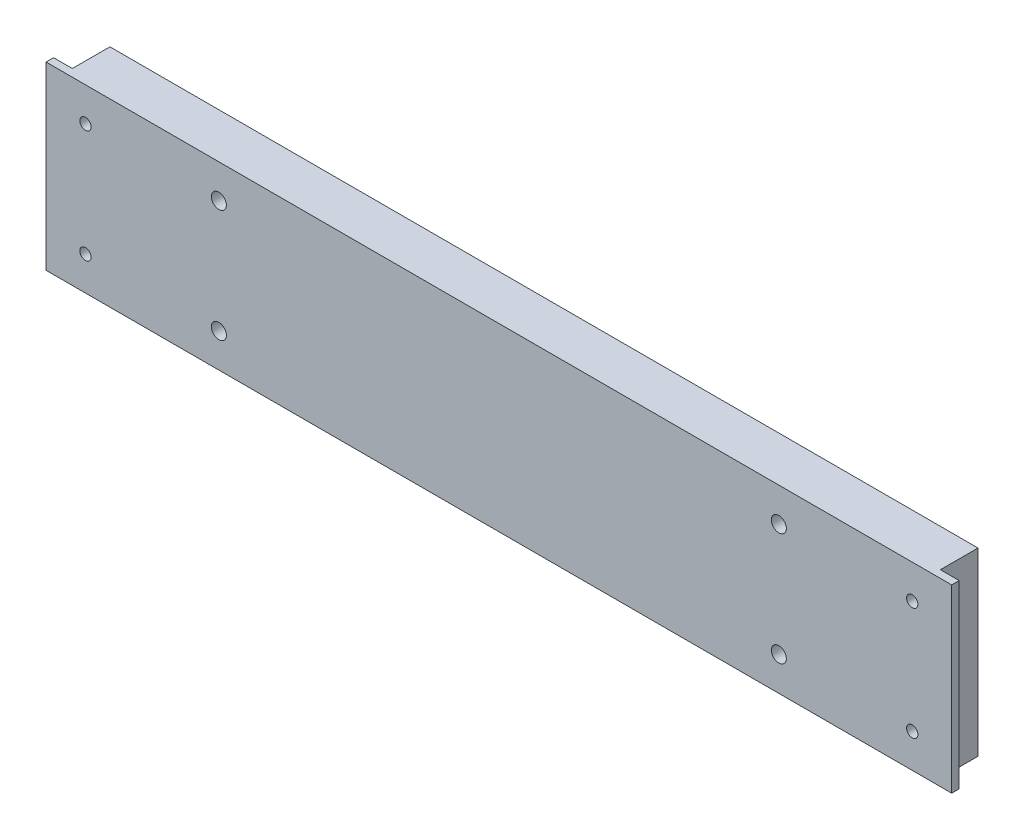
ISO-10303-21;
HEADER;
FILE_DESCRIPTION(('STEP AP214'),'2;1');
FILE_NAME('part.step','',(''),(''),'','','');
FILE_SCHEMA(('AUTOMOTIVE_DESIGN { 1 0 10303 214 1 1 1 1 }'));
ENDSEC;
DATA;
#1=APPLICATION_CONTEXT('core data for automotive mechanical design processes');
#2=APPLICATION_PROTOCOL_DEFINITION('international standard','automotive_design',2000,#1);
#3=PRODUCT_CONTEXT('',#1,'mechanical');
#4=PRODUCT('Part','Part','',(#3));
#5=PRODUCT_RELATED_PRODUCT_CATEGORY('part','',(#4));
#6=PRODUCT_DEFINITION_FORMATION('','',#4);
#7=PRODUCT_DEFINITION_CONTEXT('part definition',#1,'design');
#8=PRODUCT_DEFINITION('design','',#6,#7);
#9=PRODUCT_DEFINITION_SHAPE('','',#8);
#10=(LENGTH_UNIT() NAMED_UNIT(*) SI_UNIT(.MILLI.,.METRE.));
#11=(NAMED_UNIT(*) PLANE_ANGLE_UNIT() SI_UNIT($,.RADIAN.));
#12=(NAMED_UNIT(*) SI_UNIT($,.STERADIAN.) SOLID_ANGLE_UNIT());
#13=UNCERTAINTY_MEASURE_WITH_UNIT(LENGTH_MEASURE(1.E-05),#10,'distance_accuracy_value','');
#14=(GEOMETRIC_REPRESENTATION_CONTEXT(3) GLOBAL_UNCERTAINTY_ASSIGNED_CONTEXT((#13)) GLOBAL_UNIT_ASSIGNED_CONTEXT((#10,
#11,#12)) REPRESENTATION_CONTEXT('',''));
#15=CARTESIAN_POINT('',(0.,0.,0.));
#16=DIRECTION('',(0.,0.,1.));
#17=DIRECTION('',(1.,0.,0.));
#18=AXIS2_PLACEMENT_3D('',#15,#16,#17);
#19=CARTESIAN_POINT('',(0.,-48.,12.));
#20=DIRECTION('',(0.,0.,1.));
#21=DIRECTION('',(1.,0.,0.));
#22=AXIS2_PLACEMENT_3D('',#19,#20,#21);
#23=PLANE('',#22);
#24=CARTESIAN_POINT('',(46.,-8.99999999999999,12.));
#25=DIRECTION('',(0.,0.,1.));
#26=DIRECTION('',(1.,0.,0.));
#27=AXIS2_PLACEMENT_3D('',#24,#25,#26);
#28=CIRCLE('',#27,2.);
#29=CARTESIAN_POINT('',(48.,-8.99999999999999,12.));
#30=VERTEX_POINT('',#29);
#31=EDGE_CURVE('E172',#30,#30,#28,.T.);
#32=ORIENTED_EDGE('',*,*,#31,.F.);
#33=EDGE_LOOP('',(#32));
#34=FACE_BOUND('',#33,.T.);
#35=CARTESIAN_POINT('',(195.,-39.,12.));
#36=DIRECTION('',(0.,0.,1.));
#37=DIRECTION('',(-1.,0.,0.));
#38=AXIS2_PLACEMENT_3D('',#35,#36,#37);
#39=CIRCLE('',#38,2.00000000000002);
#40=CARTESIAN_POINT('',(193.,-39.,12.));
#41=VERTEX_POINT('',#40);
#42=EDGE_CURVE('E184',#41,#41,#39,.T.);
#43=ORIENTED_EDGE('',*,*,#42,.F.);
#44=EDGE_LOOP('',(#43));
#45=FACE_BOUND('',#44,.T.);
#46=CARTESIAN_POINT('',(230.5,-39.,12.));
#47=DIRECTION('',(0.,0.,1.));
#48=DIRECTION('',(-1.,0.,0.));
#49=AXIS2_PLACEMENT_3D('',#46,#47,#48);
#50=CIRCLE('',#49,1.5);
#51=CARTESIAN_POINT('',(229.,-39.,12.));
#52=VERTEX_POINT('',#51);
#53=EDGE_CURVE('E196',#52,#52,#50,.T.);
#54=ORIENTED_EDGE('',*,*,#53,.F.);
#55=EDGE_LOOP('',(#54));
#56=FACE_BOUND('',#55,.T.);
#57=CARTESIAN_POINT('',(10.5,-9.,12.));
#58=DIRECTION('',(0.,0.,1.));
#59=DIRECTION('',(1.,0.,0.));
#60=AXIS2_PLACEMENT_3D('',#57,#58,#59);
#61=CIRCLE('',#60,1.5);
#62=CARTESIAN_POINT('',(12.,-9.,12.));
#63=VERTEX_POINT('',#62);
#64=EDGE_CURVE('E121',#63,#63,#61,.T.);
#65=ORIENTED_EDGE('',*,*,#64,.F.);
#66=EDGE_LOOP('',(#65));
#67=FACE_BOUND('',#66,.T.);
#68=DIRECTION('',(0.,-1.,0.));
#69=VECTOR('',#68,1.);
#70=CARTESIAN_POINT('',(0.,0.,12.));
#71=LINE('',#70,#69);
#72=CARTESIAN_POINT('',(0.,0.,12.));
#73=VERTEX_POINT('',#72);
#74=CARTESIAN_POINT('',(0.,-48.,12.));
#75=VERTEX_POINT('',#74);
#76=EDGE_CURVE('E123',#73,#75,#71,.T.);
#77=ORIENTED_EDGE('',*,*,#76,.T.);
#78=DIRECTION('',(1.,0.,0.));
#79=VECTOR('',#78,1.);
#80=CARTESIAN_POINT('',(0.,-48.,12.));
#81=LINE('',#80,#79);
#82=CARTESIAN_POINT('',(241.,-48.,12.));
#83=VERTEX_POINT('',#82);
#84=EDGE_CURVE('E147',#75,#83,#81,.T.);
#85=ORIENTED_EDGE('',*,*,#84,.T.);
#86=DIRECTION('',(0.,1.,0.));
#87=VECTOR('',#86,1.);
#88=CARTESIAN_POINT('',(241.,0.,12.));
#89=LINE('',#88,#87);
#90=CARTESIAN_POINT('',(241.,0.,12.));
#91=VERTEX_POINT('',#90);
#92=EDGE_CURVE('E145',#83,#91,#89,.T.);
#93=ORIENTED_EDGE('',*,*,#92,.T.);
#94=DIRECTION('',(-1.,0.,0.));
#95=VECTOR('',#94,1.);
#96=CARTESIAN_POINT('',(0.,0.,12.));
#97=LINE('',#96,#95);
#98=EDGE_CURVE('E129',#91,#73,#97,.T.);
#99=ORIENTED_EDGE('',*,*,#98,.T.);
#100=EDGE_LOOP('',(#77,#85,#93,#99));
#101=FACE_BOUND('',#100,.T.);
#102=CARTESIAN_POINT('',(10.5,-39.,12.));
#103=DIRECTION('',(0.,0.,1.));
#104=DIRECTION('',(1.,0.,0.));
#105=AXIS2_PLACEMENT_3D('',#102,#103,#104);
#106=CIRCLE('',#105,1.5);
#107=CARTESIAN_POINT('',(12.,-39.,12.));
#108=VERTEX_POINT('',#107);
#109=EDGE_CURVE('E202',#108,#108,#106,.T.);
#110=ORIENTED_EDGE('',*,*,#109,.F.);
#111=EDGE_LOOP('',(#110));
#112=FACE_BOUND('',#111,.T.);
#113=CARTESIAN_POINT('',(230.5,-8.99999999999998,12.));
#114=DIRECTION('',(0.,0.,1.));
#115=DIRECTION('',(-1.,0.,0.));
#116=AXIS2_PLACEMENT_3D('',#113,#114,#115);
#117=CIRCLE('',#116,1.5);
#118=CARTESIAN_POINT('',(229.,-8.99999999999998,12.));
#119=VERTEX_POINT('',#118);
#120=EDGE_CURVE('E190',#119,#119,#117,.T.);
#121=ORIENTED_EDGE('',*,*,#120,.F.);
#122=EDGE_LOOP('',(#121));
#123=FACE_BOUND('',#122,.T.);
#124=CARTESIAN_POINT('',(195.,-8.99999999999999,12.));
#125=DIRECTION('',(0.,0.,1.));
#126=DIRECTION('',(-1.,0.,0.));
#127=AXIS2_PLACEMENT_3D('',#124,#125,#126);
#128=CIRCLE('',#127,2.00000000000002);
#129=CARTESIAN_POINT('',(193.,-8.99999999999999,12.));
#130=VERTEX_POINT('',#129);
#131=EDGE_CURVE('E178',#130,#130,#128,.T.);
#132=ORIENTED_EDGE('',*,*,#131,.F.);
#133=EDGE_LOOP('',(#132));
#134=FACE_BOUND('',#133,.T.);
#135=CARTESIAN_POINT('',(46.,-39.,12.));
#136=DIRECTION('',(0.,0.,1.));
#137=DIRECTION('',(1.,0.,0.));
#138=AXIS2_PLACEMENT_3D('',#135,#136,#137);
#139=CIRCLE('',#138,2.);
#140=CARTESIAN_POINT('',(48.,-39.,12.));
#141=VERTEX_POINT('',#140);
#142=EDGE_CURVE('E166',#141,#141,#139,.T.);
#143=ORIENTED_EDGE('',*,*,#142,.F.);
#144=EDGE_LOOP('',(#143));
#145=FACE_BOUND('',#144,.T.);
#146=ADVANCED_FACE('F31',(#34,#45,#56,#67,#101,#112,#123,#134,#145),#23,.T.);
#147=CARTESIAN_POINT('',(0.,-48.,0.));
#148=DIRECTION('',(0.,0.,1.));
#149=DIRECTION('',(1.,0.,0.));
#150=AXIS2_PLACEMENT_3D('',#147,#148,#149);
#151=PLANE('',#150);
#152=CARTESIAN_POINT('',(46.,-8.99999999999999,0.));
#153=DIRECTION('',(0.,0.,1.));
#154=DIRECTION('',(1.,0.,0.));
#155=AXIS2_PLACEMENT_3D('',#152,#153,#154);
#156=CIRCLE('',#155,2.);
#157=CARTESIAN_POINT('',(48.,-8.99999999999999,0.));
#158=VERTEX_POINT('',#157);
#159=EDGE_CURVE('E169',#158,#158,#156,.T.);
#160=ORIENTED_EDGE('',*,*,#159,.T.);
#161=EDGE_LOOP('',(#160));
#162=FACE_BOUND('',#161,.T.);
#163=CARTESIAN_POINT('',(195.,-39.,0.));
#164=DIRECTION('',(0.,0.,1.));
#165=DIRECTION('',(-1.,0.,0.));
#166=AXIS2_PLACEMENT_3D('',#163,#164,#165);
#167=CIRCLE('',#166,2.00000000000002);
#168=CARTESIAN_POINT('',(193.,-39.,0.));
#169=VERTEX_POINT('',#168);
#170=EDGE_CURVE('E181',#169,#169,#167,.T.);
#171=ORIENTED_EDGE('',*,*,#170,.T.);
#172=EDGE_LOOP('',(#171));
#173=FACE_BOUND('',#172,.T.);
#174=CARTESIAN_POINT('',(230.5,-39.,0.));
#175=DIRECTION('',(0.,0.,1.));
#176=DIRECTION('',(-1.,0.,0.));
#177=AXIS2_PLACEMENT_3D('',#174,#175,#176);
#178=CIRCLE('',#177,1.5);
#179=CARTESIAN_POINT('',(229.,-39.,0.));
#180=VERTEX_POINT('',#179);
#181=EDGE_CURVE('E193',#180,#180,#178,.T.);
#182=ORIENTED_EDGE('',*,*,#181,.T.);
#183=EDGE_LOOP('',(#182));
#184=FACE_BOUND('',#183,.T.);
#185=CARTESIAN_POINT('',(10.5,-9.,0.));
#186=DIRECTION('',(0.,0.,1.));
#187=DIRECTION('',(1.,0.,0.));
#188=AXIS2_PLACEMENT_3D('',#185,#186,#187);
#189=CIRCLE('',#188,1.5);
#190=CARTESIAN_POINT('',(12.,-9.,0.));
#191=VERTEX_POINT('',#190);
#192=EDGE_CURVE('E126',#191,#191,#189,.T.);
#193=ORIENTED_EDGE('',*,*,#192,.T.);
#194=EDGE_LOOP('',(#193));
#195=FACE_BOUND('',#194,.T.);
#196=DIRECTION('',(1.,0.,0.));
#197=VECTOR('',#196,1.);
#198=CARTESIAN_POINT('',(0.,-48.,0.));
#199=LINE('',#198,#197);
#200=CARTESIAN_POINT('',(5.,-48.,0.));
#201=VERTEX_POINT('',#200);
#202=CARTESIAN_POINT('',(236.,-48.,0.));
#203=VERTEX_POINT('',#202);
#204=EDGE_CURVE('E115',#201,#203,#199,.T.);
#205=ORIENTED_EDGE('',*,*,#204,.F.);
#206=DIRECTION('',(0.,1.,0.));
#207=VECTOR('',#206,1.);
#208=CARTESIAN_POINT('',(5.,-48.,0.));
#209=LINE('',#208,#207);
#210=CARTESIAN_POINT('',(5.,0.,0.));
#211=VERTEX_POINT('',#210);
#212=EDGE_CURVE('E99',#201,#211,#209,.T.);
#213=ORIENTED_EDGE('',*,*,#212,.T.);
#214=DIRECTION('',(-1.,0.,0.));
#215=VECTOR('',#214,1.);
#216=CARTESIAN_POINT('',(0.,0.,0.));
#217=LINE('',#216,#215);
#218=CARTESIAN_POINT('',(236.,0.,0.));
#219=VERTEX_POINT('',#218);
#220=EDGE_CURVE('E120',#219,#211,#217,.T.);
#221=ORIENTED_EDGE('',*,*,#220,.F.);
#222=DIRECTION('',(0.,1.,0.));
#223=VECTOR('',#222,1.);
#224=CARTESIAN_POINT('',(236.,-48.,0.));
#225=LINE('',#224,#223);
#226=EDGE_CURVE('E54',#203,#219,#225,.T.);
#227=ORIENTED_EDGE('',*,*,#226,.F.);
#228=EDGE_LOOP('',(#205,#213,#221,#227));
#229=FACE_BOUND('',#228,.T.);
#230=CARTESIAN_POINT('',(10.5,-39.,0.));
#231=DIRECTION('',(0.,0.,1.));
#232=DIRECTION('',(1.,0.,0.));
#233=AXIS2_PLACEMENT_3D('',#230,#231,#232);
#234=CIRCLE('',#233,1.5);
#235=CARTESIAN_POINT('',(12.,-39.,0.));
#236=VERTEX_POINT('',#235);
#237=EDGE_CURVE('E199',#236,#236,#234,.T.);
#238=ORIENTED_EDGE('',*,*,#237,.T.);
#239=EDGE_LOOP('',(#238));
#240=FACE_BOUND('',#239,.T.);
#241=CARTESIAN_POINT('',(230.5,-8.99999999999998,0.));
#242=DIRECTION('',(0.,0.,1.));
#243=DIRECTION('',(-1.,0.,0.));
#244=AXIS2_PLACEMENT_3D('',#241,#242,#243);
#245=CIRCLE('',#244,1.5);
#246=CARTESIAN_POINT('',(229.,-8.99999999999998,0.));
#247=VERTEX_POINT('',#246);
#248=EDGE_CURVE('E187',#247,#247,#245,.T.);
#249=ORIENTED_EDGE('',*,*,#248,.T.);
#250=EDGE_LOOP('',(#249));
#251=FACE_BOUND('',#250,.T.);
#252=CARTESIAN_POINT('',(195.,-8.99999999999999,0.));
#253=DIRECTION('',(0.,0.,1.));
#254=DIRECTION('',(-1.,0.,0.));
#255=AXIS2_PLACEMENT_3D('',#252,#253,#254);
#256=CIRCLE('',#255,2.00000000000002);
#257=CARTESIAN_POINT('',(193.,-8.99999999999999,0.));
#258=VERTEX_POINT('',#257);
#259=EDGE_CURVE('E175',#258,#258,#256,.T.);
#260=ORIENTED_EDGE('',*,*,#259,.T.);
#261=EDGE_LOOP('',(#260));
#262=FACE_BOUND('',#261,.T.);
#263=CARTESIAN_POINT('',(46.,-39.,0.));
#264=DIRECTION('',(0.,0.,1.));
#265=DIRECTION('',(1.,0.,0.));
#266=AXIS2_PLACEMENT_3D('',#263,#264,#265);
#267=CIRCLE('',#266,2.);
#268=CARTESIAN_POINT('',(48.,-39.,0.));
#269=VERTEX_POINT('',#268);
#270=EDGE_CURVE('E164',#269,#269,#267,.T.);
#271=ORIENTED_EDGE('',*,*,#270,.T.);
#272=EDGE_LOOP('',(#271));
#273=FACE_BOUND('',#272,.T.);
#274=ADVANCED_FACE('F118',(#162,#173,#184,#195,#229,#240,#251,#262,#273),#151,.F.);
#275=CARTESIAN_POINT('',(0.,0.,12.));
#276=DIRECTION('',(1.,0.,0.));
#277=DIRECTION('',(0.,1.,0.));
#278=AXIS2_PLACEMENT_3D('',#275,#276,#277);
#279=PLANE('',#278);
#280=DIRECTION('',(0.,0.,-1.));
#281=VECTOR('',#280,1.);
#282=CARTESIAN_POINT('',(0.,0.,12.));
#283=LINE('',#282,#281);
#284=CARTESIAN_POINT('',(0.,0.,10.));
#285=VERTEX_POINT('',#284);
#286=EDGE_CURVE('E132',#73,#285,#283,.T.);
#287=ORIENTED_EDGE('',*,*,#286,.T.);
#288=DIRECTION('',(0.,1.,0.));
#289=VECTOR('',#288,1.);
#290=CARTESIAN_POINT('',(0.,-48.,10.));
#291=LINE('',#290,#289);
#292=CARTESIAN_POINT('',(0.,-48.,10.));
#293=VERTEX_POINT('',#292);
#294=EDGE_CURVE('E46',#293,#285,#291,.T.);
#295=ORIENTED_EDGE('',*,*,#294,.F.);
#296=DIRECTION('',(0.,0.,-1.));
#297=VECTOR('',#296,1.);
#298=CARTESIAN_POINT('',(0.,-48.,12.));
#299=LINE('',#298,#297);
#300=EDGE_CURVE('E11',#75,#293,#299,.T.);
#301=ORIENTED_EDGE('',*,*,#300,.F.);
#302=ORIENTED_EDGE('',*,*,#76,.F.);
#303=EDGE_LOOP('',(#287,#295,#301,#302));
#304=FACE_BOUND('',#303,.T.);
#305=ADVANCED_FACE('F33',(#304),#279,.F.);
#306=CARTESIAN_POINT('',(0.,-48.,12.));
#307=DIRECTION('',(0.,1.,0.));
#308=DIRECTION('',(-1.,0.,0.));
#309=AXIS2_PLACEMENT_3D('',#306,#307,#308);
#310=PLANE('',#309);
#311=DIRECTION('',(1.,0.,0.));
#312=VECTOR('',#311,1.);
#313=CARTESIAN_POINT('',(5.,-48.,10.));
#314=LINE('',#313,#312);
#315=CARTESIAN_POINT('',(5.,-48.,10.));
#316=VERTEX_POINT('',#315);
#317=EDGE_CURVE('E110',#293,#316,#314,.T.);
#318=ORIENTED_EDGE('',*,*,#317,.T.);
#319=DIRECTION('',(0.,0.,-1.));
#320=VECTOR('',#319,1.);
#321=CARTESIAN_POINT('',(5.,-48.,0.));
#322=LINE('',#321,#320);
#323=EDGE_CURVE('E102',#316,#201,#322,.T.);
#324=ORIENTED_EDGE('',*,*,#323,.T.);
#325=ORIENTED_EDGE('',*,*,#204,.T.);
#326=DIRECTION('',(0.,0.,1.));
#327=VECTOR('',#326,1.);
#328=CARTESIAN_POINT('',(236.,-48.,0.));
#329=LINE('',#328,#327);
#330=CARTESIAN_POINT('',(236.,-48.,10.));
#331=VERTEX_POINT('',#330);
#332=EDGE_CURVE('E151',#203,#331,#329,.T.);
#333=ORIENTED_EDGE('',*,*,#332,.T.);
#334=DIRECTION('',(1.,0.,0.));
#335=VECTOR('',#334,1.);
#336=CARTESIAN_POINT('',(236.,-48.,10.));
#337=LINE('',#336,#335);
#338=CARTESIAN_POINT('',(241.,-48.,10.));
#339=VERTEX_POINT('',#338);
#340=EDGE_CURVE('E150',#331,#339,#337,.T.);
#341=ORIENTED_EDGE('',*,*,#340,.T.);
#342=DIRECTION('',(0.,0.,-1.));
#343=VECTOR('',#342,1.);
#344=CARTESIAN_POINT('',(241.,-48.,12.));
#345=LINE('',#344,#343);
#346=EDGE_CURVE('E39',#83,#339,#345,.T.);
#347=ORIENTED_EDGE('',*,*,#346,.F.);
#348=ORIENTED_EDGE('',*,*,#84,.F.);
#349=ORIENTED_EDGE('',*,*,#300,.T.);
#350=EDGE_LOOP('',(#318,#324,#325,#333,#341,#347,#348,#349));
#351=FACE_BOUND('',#350,.T.);
#352=ADVANCED_FACE('F113',(#351),#310,.F.);
#353=CARTESIAN_POINT('',(241.,0.,12.));
#354=DIRECTION('',(-1.,0.,0.));
#355=DIRECTION('',(0.,0.,1.));
#356=AXIS2_PLACEMENT_3D('',#353,#354,#355);
#357=PLANE('',#356);
#358=ORIENTED_EDGE('',*,*,#346,.T.);
#359=DIRECTION('',(0.,1.,0.));
#360=VECTOR('',#359,1.);
#361=CARTESIAN_POINT('',(241.,-48.,10.));
#362=LINE('',#361,#360);
#363=CARTESIAN_POINT('',(241.,0.,10.));
#364=VERTEX_POINT('',#363);
#365=EDGE_CURVE('E144',#339,#364,#362,.T.);
#366=ORIENTED_EDGE('',*,*,#365,.T.);
#367=DIRECTION('',(0.,0.,-1.));
#368=VECTOR('',#367,1.);
#369=CARTESIAN_POINT('',(241.,0.,12.));
#370=LINE('',#369,#368);
#371=EDGE_CURVE('E135',#91,#364,#370,.T.);
#372=ORIENTED_EDGE('',*,*,#371,.F.);
#373=ORIENTED_EDGE('',*,*,#92,.F.);
#374=EDGE_LOOP('',(#358,#366,#372,#373));
#375=FACE_BOUND('',#374,.T.);
#376=ADVANCED_FACE('F142',(#375),#357,.F.);
#377=CARTESIAN_POINT('',(0.,0.,12.));
#378=DIRECTION('',(0.,-1.,0.));
#379=DIRECTION('',(1.,0.,0.));
#380=AXIS2_PLACEMENT_3D('',#377,#378,#379);
#381=PLANE('',#380);
#382=ORIENTED_EDGE('',*,*,#220,.T.);
#383=DIRECTION('',(0.,0.,-1.));
#384=VECTOR('',#383,1.);
#385=CARTESIAN_POINT('',(5.,0.,0.));
#386=LINE('',#385,#384);
#387=CARTESIAN_POINT('',(5.,0.,10.));
#388=VERTEX_POINT('',#387);
#389=EDGE_CURVE('E105',#388,#211,#386,.T.);
#390=ORIENTED_EDGE('',*,*,#389,.F.);
#391=DIRECTION('',(1.,0.,0.));
#392=VECTOR('',#391,1.);
#393=CARTESIAN_POINT('',(5.,0.,10.));
#394=LINE('',#393,#392);
#395=EDGE_CURVE('E116',#285,#388,#394,.T.);
#396=ORIENTED_EDGE('',*,*,#395,.F.);
#397=ORIENTED_EDGE('',*,*,#286,.F.);
#398=ORIENTED_EDGE('',*,*,#98,.F.);
#399=ORIENTED_EDGE('',*,*,#371,.T.);
#400=DIRECTION('',(1.,0.,0.));
#401=VECTOR('',#400,1.);
#402=CARTESIAN_POINT('',(236.,0.,10.));
#403=LINE('',#402,#401);
#404=CARTESIAN_POINT('',(236.,0.,10.));
#405=VERTEX_POINT('',#404);
#406=EDGE_CURVE('E156',#405,#364,#403,.T.);
#407=ORIENTED_EDGE('',*,*,#406,.F.);
#408=DIRECTION('',(0.,0.,1.));
#409=VECTOR('',#408,1.);
#410=CARTESIAN_POINT('',(236.,0.,0.));
#411=LINE('',#410,#409);
#412=EDGE_CURVE('E159',#219,#405,#411,.T.);
#413=ORIENTED_EDGE('',*,*,#412,.F.);
#414=EDGE_LOOP('',(#382,#390,#396,#397,#398,#399,#407,#413));
#415=FACE_BOUND('',#414,.T.);
#416=ADVANCED_FACE('F217',(#415),#381,.F.);
#417=CARTESIAN_POINT('',(10.5,-9.,12.));
#418=DIRECTION('',(0.,0.,-1.));
#419=DIRECTION('',(-1.,0.,0.));
#420=AXIS2_PLACEMENT_3D('',#417,#418,#419);
#421=CYLINDRICAL_SURFACE('',#420,1.5);
#422=ORIENTED_EDGE('',*,*,#64,.T.);
#423=EDGE_LOOP('',(#422));
#424=FACE_BOUND('',#423,.T.);
#425=ORIENTED_EDGE('',*,*,#192,.F.);
#426=EDGE_LOOP('',(#425));
#427=FACE_BOUND('',#426,.T.);
#428=ADVANCED_FACE('F251',(#424,#427),#421,.F.);
#429=CARTESIAN_POINT('',(10.5,-39.,12.));
#430=DIRECTION('',(0.,0.,-1.));
#431=DIRECTION('',(-1.,0.,0.));
#432=AXIS2_PLACEMENT_3D('',#429,#430,#431);
#433=CYLINDRICAL_SURFACE('',#432,1.5);
#434=ORIENTED_EDGE('',*,*,#109,.T.);
#435=EDGE_LOOP('',(#434));
#436=FACE_BOUND('',#435,.T.);
#437=ORIENTED_EDGE('',*,*,#237,.F.);
#438=EDGE_LOOP('',(#437));
#439=FACE_BOUND('',#438,.T.);
#440=ADVANCED_FACE('F324',(#436,#439),#433,.F.);
#441=CARTESIAN_POINT('',(230.5,-39.,12.));
#442=DIRECTION('',(0.,0.,-1.));
#443=DIRECTION('',(-1.,0.,0.));
#444=AXIS2_PLACEMENT_3D('',#441,#442,#443);
#445=CYLINDRICAL_SURFACE('',#444,1.5);
#446=ORIENTED_EDGE('',*,*,#53,.T.);
#447=EDGE_LOOP('',(#446));
#448=FACE_BOUND('',#447,.T.);
#449=ORIENTED_EDGE('',*,*,#181,.F.);
#450=EDGE_LOOP('',(#449));
#451=FACE_BOUND('',#450,.T.);
#452=ADVANCED_FACE('F314',(#448,#451),#445,.F.);
#453=CARTESIAN_POINT('',(230.5,-8.99999999999998,12.));
#454=DIRECTION('',(0.,0.,-1.));
#455=DIRECTION('',(-1.,0.,0.));
#456=AXIS2_PLACEMENT_3D('',#453,#454,#455);
#457=CYLINDRICAL_SURFACE('',#456,1.5);
#458=ORIENTED_EDGE('',*,*,#120,.T.);
#459=EDGE_LOOP('',(#458));
#460=FACE_BOUND('',#459,.T.);
#461=ORIENTED_EDGE('',*,*,#248,.F.);
#462=EDGE_LOOP('',(#461));
#463=FACE_BOUND('',#462,.T.);
#464=ADVANCED_FACE('F304',(#460,#463),#457,.F.);
#465=CARTESIAN_POINT('',(195.,-39.,12.));
#466=DIRECTION('',(0.,0.,-1.));
#467=DIRECTION('',(-1.,0.,0.));
#468=AXIS2_PLACEMENT_3D('',#465,#466,#467);
#469=CYLINDRICAL_SURFACE('',#468,2.00000000000002);
#470=ORIENTED_EDGE('',*,*,#42,.T.);
#471=EDGE_LOOP('',(#470));
#472=FACE_BOUND('',#471,.T.);
#473=ORIENTED_EDGE('',*,*,#170,.F.);
#474=EDGE_LOOP('',(#473));
#475=FACE_BOUND('',#474,.T.);
#476=ADVANCED_FACE('F294',(#472,#475),#469,.F.);
#477=CARTESIAN_POINT('',(195.,-8.99999999999999,12.));
#478=DIRECTION('',(0.,0.,-1.));
#479=DIRECTION('',(-1.,0.,0.));
#480=AXIS2_PLACEMENT_3D('',#477,#478,#479);
#481=CYLINDRICAL_SURFACE('',#480,2.00000000000002);
#482=ORIENTED_EDGE('',*,*,#131,.T.);
#483=EDGE_LOOP('',(#482));
#484=FACE_BOUND('',#483,.T.);
#485=ORIENTED_EDGE('',*,*,#259,.F.);
#486=EDGE_LOOP('',(#485));
#487=FACE_BOUND('',#486,.T.);
#488=ADVANCED_FACE('F284',(#484,#487),#481,.F.);
#489=CARTESIAN_POINT('',(46.,-8.99999999999999,12.));
#490=DIRECTION('',(0.,0.,-1.));
#491=DIRECTION('',(-1.,0.,0.));
#492=AXIS2_PLACEMENT_3D('',#489,#490,#491);
#493=CYLINDRICAL_SURFACE('',#492,2.);
#494=ORIENTED_EDGE('',*,*,#31,.T.);
#495=EDGE_LOOP('',(#494));
#496=FACE_BOUND('',#495,.T.);
#497=ORIENTED_EDGE('',*,*,#159,.F.);
#498=EDGE_LOOP('',(#497));
#499=FACE_BOUND('',#498,.T.);
#500=ADVANCED_FACE('F236',(#496,#499),#493,.F.);
#501=CARTESIAN_POINT('',(46.,-39.,12.));
#502=DIRECTION('',(0.,0.,-1.));
#503=DIRECTION('',(-1.,0.,0.));
#504=AXIS2_PLACEMENT_3D('',#501,#502,#503);
#505=CYLINDRICAL_SURFACE('',#504,2.);
#506=ORIENTED_EDGE('',*,*,#142,.T.);
#507=EDGE_LOOP('',(#506));
#508=FACE_BOUND('',#507,.T.);
#509=ORIENTED_EDGE('',*,*,#270,.F.);
#510=EDGE_LOOP('',(#509));
#511=FACE_BOUND('',#510,.T.);
#512=ADVANCED_FACE('F229',(#508,#511),#505,.F.);
#513=CARTESIAN_POINT('',(236.,-48.,10.));
#514=DIRECTION('',(0.,0.,1.));
#515=DIRECTION('',(1.,0.,0.));
#516=AXIS2_PLACEMENT_3D('',#513,#514,#515);
#517=PLANE('',#516);
#518=ORIENTED_EDGE('',*,*,#406,.T.);
#519=ORIENTED_EDGE('',*,*,#365,.F.);
#520=ORIENTED_EDGE('',*,*,#340,.F.);
#521=DIRECTION('',(0.,1.,0.));
#522=VECTOR('',#521,1.);
#523=CARTESIAN_POINT('',(236.,-48.,10.));
#524=LINE('',#523,#522);
#525=EDGE_CURVE('E154',#331,#405,#524,.T.);
#526=ORIENTED_EDGE('',*,*,#525,.T.);
#527=EDGE_LOOP('',(#518,#519,#520,#526));
#528=FACE_BOUND('',#527,.T.);
#529=ADVANCED_FACE('F227',(#528),#517,.F.);
#530=CARTESIAN_POINT('',(236.,-48.,0.));
#531=DIRECTION('',(-1.,0.,0.));
#532=DIRECTION('',(0.,0.,1.));
#533=AXIS2_PLACEMENT_3D('',#530,#531,#532);
#534=PLANE('',#533);
#535=ORIENTED_EDGE('',*,*,#412,.T.);
#536=ORIENTED_EDGE('',*,*,#525,.F.);
#537=ORIENTED_EDGE('',*,*,#332,.F.);
#538=ORIENTED_EDGE('',*,*,#226,.T.);
#539=EDGE_LOOP('',(#535,#536,#537,#538));
#540=FACE_BOUND('',#539,.T.);
#541=ADVANCED_FACE('F226',(#540),#534,.F.);
#542=CARTESIAN_POINT('',(5.,-48.,0.));
#543=DIRECTION('',(1.,0.,0.));
#544=DIRECTION('',(0.,0.,-1.));
#545=AXIS2_PLACEMENT_3D('',#542,#543,#544);
#546=PLANE('',#545);
#547=ORIENTED_EDGE('',*,*,#389,.T.);
#548=ORIENTED_EDGE('',*,*,#212,.F.);
#549=ORIENTED_EDGE('',*,*,#323,.F.);
#550=DIRECTION('',(0.,1.,0.));
#551=VECTOR('',#550,1.);
#552=CARTESIAN_POINT('',(5.,-48.,10.));
#553=LINE('',#552,#551);
#554=EDGE_CURVE('E161',#316,#388,#553,.T.);
#555=ORIENTED_EDGE('',*,*,#554,.T.);
#556=EDGE_LOOP('',(#547,#548,#549,#555));
#557=FACE_BOUND('',#556,.T.);
#558=ADVANCED_FACE('F101',(#557),#546,.F.);
#559=CARTESIAN_POINT('',(5.,-48.,10.));
#560=DIRECTION('',(0.,0.,1.));
#561=DIRECTION('',(1.,0.,0.));
#562=AXIS2_PLACEMENT_3D('',#559,#560,#561);
#563=PLANE('',#562);
#564=ORIENTED_EDGE('',*,*,#395,.T.);
#565=ORIENTED_EDGE('',*,*,#554,.F.);
#566=ORIENTED_EDGE('',*,*,#317,.F.);
#567=ORIENTED_EDGE('',*,*,#294,.T.);
#568=EDGE_LOOP('',(#564,#565,#566,#567));
#569=FACE_BOUND('',#568,.T.);
#570=ADVANCED_FACE('F224',(#569),#563,.F.);
#571=CLOSED_SHELL('',(#146,#274,#305,#352,#376,#416,#428,#440,#452,#464,#476,#488,#500,#512,
#529,#541,#558,#570));
#572=MANIFOLD_SOLID_BREP('B2',#571);
#573=ADVANCED_BREP_SHAPE_REPRESENTATION('',(#18,#572),#14);
#574=SHAPE_DEFINITION_REPRESENTATION(#9,#573);
ENDSEC;
END-ISO-10303-21;
